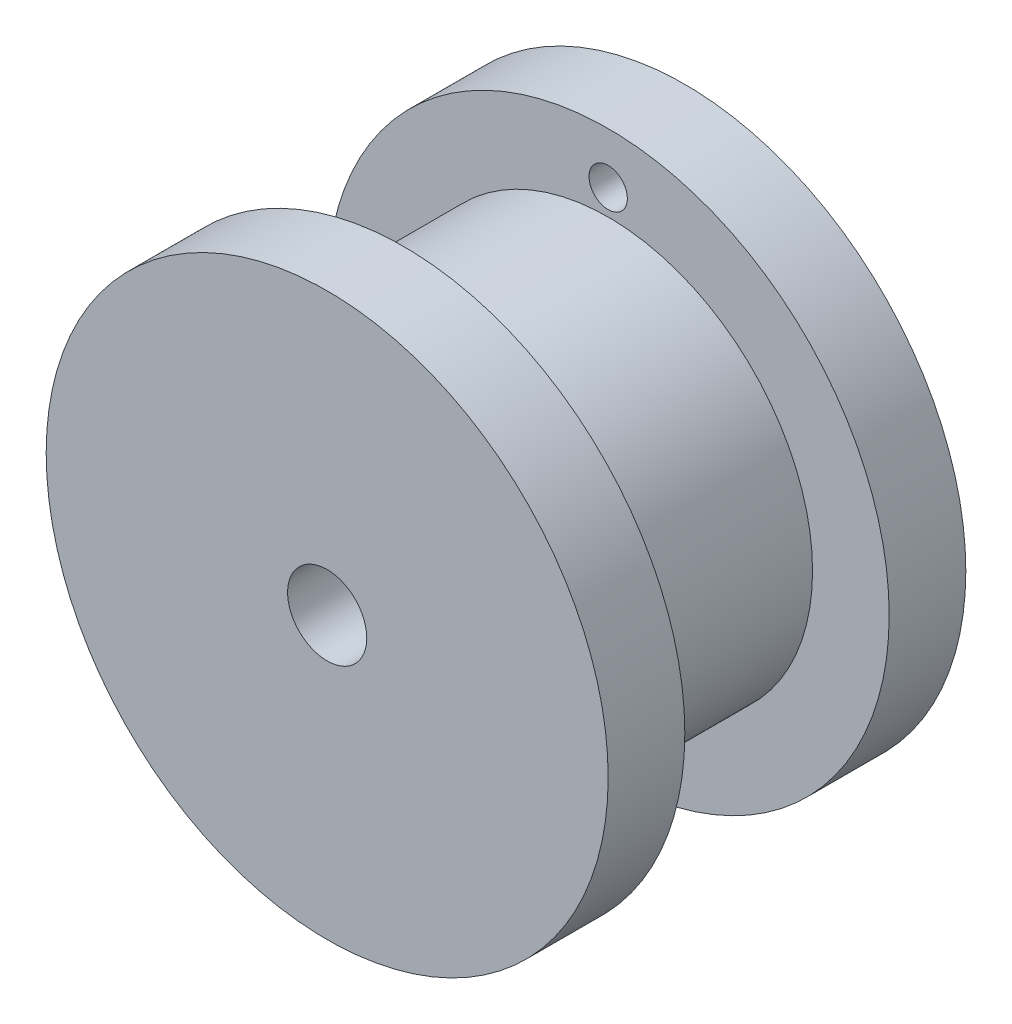
ISO-10303-21;
HEADER;
FILE_DESCRIPTION(('STEP AP214'),'2;1');
FILE_NAME('part.step','',(''),(''),'','','');
FILE_SCHEMA(('AUTOMOTIVE_DESIGN { 1 0 10303 214 1 1 1 1 }'));
ENDSEC;
DATA;
#1=APPLICATION_CONTEXT('core data for automotive mechanical design processes');
#2=APPLICATION_PROTOCOL_DEFINITION('international standard','automotive_design',2000,#1);
#3=PRODUCT_CONTEXT('',#1,'mechanical');
#4=PRODUCT('Part','Part','',(#3));
#5=PRODUCT_RELATED_PRODUCT_CATEGORY('part','',(#4));
#6=PRODUCT_DEFINITION_FORMATION('','',#4);
#7=PRODUCT_DEFINITION_CONTEXT('part definition',#1,'design');
#8=PRODUCT_DEFINITION('design','',#6,#7);
#9=PRODUCT_DEFINITION_SHAPE('','',#8);
#10=(LENGTH_UNIT() NAMED_UNIT(*) SI_UNIT(.MILLI.,.METRE.));
#11=(NAMED_UNIT(*) PLANE_ANGLE_UNIT() SI_UNIT($,.RADIAN.));
#12=(NAMED_UNIT(*) SI_UNIT($,.STERADIAN.) SOLID_ANGLE_UNIT());
#13=UNCERTAINTY_MEASURE_WITH_UNIT(LENGTH_MEASURE(1.E-05),#10,'distance_accuracy_value','');
#14=(GEOMETRIC_REPRESENTATION_CONTEXT(3) GLOBAL_UNCERTAINTY_ASSIGNED_CONTEXT((#13)) GLOBAL_UNIT_ASSIGNED_CONTEXT((#10,
#11,#12)) REPRESENTATION_CONTEXT('',''));
#15=CARTESIAN_POINT('',(0.,0.,0.));
#16=DIRECTION('',(0.,0.,1.));
#17=DIRECTION('',(1.,0.,0.));
#18=AXIS2_PLACEMENT_3D('',#15,#16,#17);
#19=CARTESIAN_POINT('',(0.,0.,3.));
#20=DIRECTION('',(0.,0.,-1.));
#21=DIRECTION('',(-1.,0.,0.));
#22=AXIS2_PLACEMENT_3D('',#19,#20,#21);
#23=CYLINDRICAL_SURFACE('',#22,11.);
#24=CARTESIAN_POINT('',(0.,0.,3.));
#25=DIRECTION('',(0.,0.,1.));
#26=DIRECTION('',(1.,0.,0.));
#27=AXIS2_PLACEMENT_3D('',#24,#25,#26);
#28=CIRCLE('',#27,11.);
#29=CARTESIAN_POINT('',(11.,0.,3.));
#30=VERTEX_POINT('',#29);
#31=EDGE_CURVE('E38',#30,#30,#28,.T.);
#32=ORIENTED_EDGE('',*,*,#31,.F.);
#33=EDGE_LOOP('',(#32));
#34=FACE_BOUND('',#33,.T.);
#35=CARTESIAN_POINT('',(0.,0.,0.));
#36=DIRECTION('',(0.,0.,1.));
#37=DIRECTION('',(1.,0.,0.));
#38=AXIS2_PLACEMENT_3D('',#35,#36,#37);
#39=CIRCLE('',#38,11.);
#40=CARTESIAN_POINT('',(11.,0.,0.));
#41=VERTEX_POINT('',#40);
#42=EDGE_CURVE('E34',#41,#41,#39,.T.);
#43=ORIENTED_EDGE('',*,*,#42,.T.);
#44=EDGE_LOOP('',(#43));
#45=FACE_BOUND('',#44,.T.);
#46=ADVANCED_FACE('F31',(#34,#45),#23,.T.);
#47=CARTESIAN_POINT('',(0.,0.,3.));
#48=DIRECTION('',(0.,0.,1.));
#49=DIRECTION('',(1.,0.,0.));
#50=AXIS2_PLACEMENT_3D('',#47,#48,#49);
#51=PLANE('',#50);
#52=CARTESIAN_POINT('',(0.,9.,3.));
#53=DIRECTION('',(0.,0.,1.));
#54=DIRECTION('',(1.,0.,0.));
#55=AXIS2_PLACEMENT_3D('',#52,#53,#54);
#56=CIRCLE('',#55,0.750000000000001);
#57=CARTESIAN_POINT('',(0.750000000000001,9.,3.));
#58=VERTEX_POINT('',#57);
#59=EDGE_CURVE('E60',#58,#58,#56,.T.);
#60=ORIENTED_EDGE('',*,*,#59,.F.);
#61=EDGE_LOOP('',(#60));
#62=FACE_BOUND('',#61,.T.);
#63=CARTESIAN_POINT('',(0.,0.,3.));
#64=DIRECTION('',(0.,0.,1.));
#65=DIRECTION('',(1.,0.,0.));
#66=AXIS2_PLACEMENT_3D('',#63,#64,#65);
#67=CIRCLE('',#66,8.);
#68=CARTESIAN_POINT('',(8.,0.,3.));
#69=VERTEX_POINT('',#68);
#70=EDGE_CURVE('E10',#69,#69,#67,.T.);
#71=ORIENTED_EDGE('',*,*,#70,.F.);
#72=EDGE_LOOP('',(#71));
#73=FACE_BOUND('',#72,.T.);
#74=ORIENTED_EDGE('',*,*,#31,.T.);
#75=EDGE_LOOP('',(#74));
#76=FACE_BOUND('',#75,.T.);
#77=ADVANCED_FACE('F76',(#62,#73,#76),#51,.T.);
#78=CARTESIAN_POINT('',(0.,0.,0.));
#79=DIRECTION('',(0.,0.,1.));
#80=DIRECTION('',(1.,0.,0.));
#81=AXIS2_PLACEMENT_3D('',#78,#79,#80);
#82=PLANE('',#81);
#83=CARTESIAN_POINT('',(0.,9.,0.));
#84=DIRECTION('',(0.,0.,1.));
#85=DIRECTION('',(1.,0.,0.));
#86=AXIS2_PLACEMENT_3D('',#83,#84,#85);
#87=CIRCLE('',#86,0.750000000000001);
#88=CARTESIAN_POINT('',(0.750000000000001,9.,0.));
#89=VERTEX_POINT('',#88);
#90=EDGE_CURVE('E57',#89,#89,#87,.T.);
#91=ORIENTED_EDGE('',*,*,#90,.T.);
#92=EDGE_LOOP('',(#91));
#93=FACE_BOUND('',#92,.T.);
#94=CARTESIAN_POINT('',(0.,0.,0.));
#95=DIRECTION('',(0.,0.,1.));
#96=DIRECTION('',(1.,0.,0.));
#97=AXIS2_PLACEMENT_3D('',#94,#95,#96);
#98=CIRCLE('',#97,1.55);
#99=CARTESIAN_POINT('',(1.55,0.,0.));
#100=VERTEX_POINT('',#99);
#101=EDGE_CURVE('E51',#100,#100,#98,.T.);
#102=ORIENTED_EDGE('',*,*,#101,.T.);
#103=EDGE_LOOP('',(#102));
#104=FACE_BOUND('',#103,.T.);
#105=ORIENTED_EDGE('',*,*,#42,.F.);
#106=EDGE_LOOP('',(#105));
#107=FACE_BOUND('',#106,.T.);
#108=ADVANCED_FACE('F66',(#93,#104,#107),#82,.F.);
#109=CARTESIAN_POINT('',(0.,0.,11.));
#110=DIRECTION('',(0.,0.,-1.));
#111=DIRECTION('',(-1.,0.,0.));
#112=AXIS2_PLACEMENT_3D('',#109,#110,#111);
#113=CYLINDRICAL_SURFACE('',#112,8.);
#114=CARTESIAN_POINT('',(0.,0.,11.));
#115=DIRECTION('',(0.,0.,1.));
#116=DIRECTION('',(1.,0.,0.));
#117=AXIS2_PLACEMENT_3D('',#114,#115,#116);
#118=CIRCLE('',#117,8.);
#119=CARTESIAN_POINT('',(8.,0.,11.));
#120=VERTEX_POINT('',#119);
#121=EDGE_CURVE('E44',#120,#120,#118,.T.);
#122=ORIENTED_EDGE('',*,*,#121,.F.);
#123=EDGE_LOOP('',(#122));
#124=FACE_BOUND('',#123,.T.);
#125=ORIENTED_EDGE('',*,*,#70,.T.);
#126=EDGE_LOOP('',(#125));
#127=FACE_BOUND('',#126,.T.);
#128=ADVANCED_FACE('F89',(#124,#127),#113,.T.);
#129=CARTESIAN_POINT('',(0.,0.,14.));
#130=DIRECTION('',(0.,0.,-1.));
#131=DIRECTION('',(-1.,0.,0.));
#132=AXIS2_PLACEMENT_3D('',#129,#130,#131);
#133=CYLINDRICAL_SURFACE('',#132,11.);
#134=CARTESIAN_POINT('',(0.,0.,14.));
#135=DIRECTION('',(0.,0.,1.));
#136=DIRECTION('',(1.,0.,0.));
#137=AXIS2_PLACEMENT_3D('',#134,#135,#136);
#138=CIRCLE('',#137,11.);
#139=CARTESIAN_POINT('',(11.,0.,14.));
#140=VERTEX_POINT('',#139);
#141=EDGE_CURVE('E47',#140,#140,#138,.T.);
#142=ORIENTED_EDGE('',*,*,#141,.F.);
#143=EDGE_LOOP('',(#142));
#144=FACE_BOUND('',#143,.T.);
#145=CARTESIAN_POINT('',(0.,0.,11.));
#146=DIRECTION('',(0.,0.,1.));
#147=DIRECTION('',(1.,0.,0.));
#148=AXIS2_PLACEMENT_3D('',#145,#146,#147);
#149=CIRCLE('',#148,11.);
#150=CARTESIAN_POINT('',(11.,0.,11.));
#151=VERTEX_POINT('',#150);
#152=EDGE_CURVE('E48',#151,#151,#149,.T.);
#153=ORIENTED_EDGE('',*,*,#152,.T.);
#154=EDGE_LOOP('',(#153));
#155=FACE_BOUND('',#154,.T.);
#156=ADVANCED_FACE('F93',(#144,#155),#133,.T.);
#157=CARTESIAN_POINT('',(0.,0.,14.));
#158=DIRECTION('',(0.,0.,1.));
#159=DIRECTION('',(1.,0.,0.));
#160=AXIS2_PLACEMENT_3D('',#157,#158,#159);
#161=PLANE('',#160);
#162=CARTESIAN_POINT('',(0.,0.,14.));
#163=DIRECTION('',(0.,0.,1.));
#164=DIRECTION('',(1.,0.,0.));
#165=AXIS2_PLACEMENT_3D('',#162,#163,#164);
#166=CIRCLE('',#165,1.55);
#167=CARTESIAN_POINT('',(1.55,0.,14.));
#168=VERTEX_POINT('',#167);
#169=EDGE_CURVE('E54',#168,#168,#166,.T.);
#170=ORIENTED_EDGE('',*,*,#169,.F.);
#171=EDGE_LOOP('',(#170));
#172=FACE_BOUND('',#171,.T.);
#173=ORIENTED_EDGE('',*,*,#141,.T.);
#174=EDGE_LOOP('',(#173));
#175=FACE_BOUND('',#174,.T.);
#176=ADVANCED_FACE('F99',(#172,#175),#161,.T.);
#177=CARTESIAN_POINT('',(0.,0.,11.));
#178=DIRECTION('',(0.,0.,1.));
#179=DIRECTION('',(1.,0.,0.));
#180=AXIS2_PLACEMENT_3D('',#177,#178,#179);
#181=PLANE('',#180);
#182=ORIENTED_EDGE('',*,*,#121,.T.);
#183=EDGE_LOOP('',(#182));
#184=FACE_BOUND('',#183,.T.);
#185=ORIENTED_EDGE('',*,*,#152,.F.);
#186=EDGE_LOOP('',(#185));
#187=FACE_BOUND('',#186,.T.);
#188=ADVANCED_FACE('F101',(#184,#187),#181,.F.);
#189=CARTESIAN_POINT('',(0.,0.,0.));
#190=DIRECTION('',(0.,0.,1.));
#191=DIRECTION('',(1.,0.,0.));
#192=AXIS2_PLACEMENT_3D('',#189,#190,#191);
#193=CYLINDRICAL_SURFACE('',#192,1.55);
#194=ORIENTED_EDGE('',*,*,#101,.F.);
#195=EDGE_LOOP('',(#194));
#196=FACE_BOUND('',#195,.T.);
#197=ORIENTED_EDGE('',*,*,#169,.T.);
#198=EDGE_LOOP('',(#197));
#199=FACE_BOUND('',#198,.T.);
#200=ADVANCED_FACE('F72',(#196,#199),#193,.F.);
#201=CARTESIAN_POINT('',(0.,9.,0.));
#202=DIRECTION('',(0.,0.,1.));
#203=DIRECTION('',(1.,0.,0.));
#204=AXIS2_PLACEMENT_3D('',#201,#202,#203);
#205=CYLINDRICAL_SURFACE('',#204,0.750000000000001);
#206=ORIENTED_EDGE('',*,*,#90,.F.);
#207=EDGE_LOOP('',(#206));
#208=FACE_BOUND('',#207,.T.);
#209=ORIENTED_EDGE('',*,*,#59,.T.);
#210=EDGE_LOOP('',(#209));
#211=FACE_BOUND('',#210,.T.);
#212=ADVANCED_FACE('F69',(#208,#211),#205,.F.);
#213=CLOSED_SHELL('',(#46,#77,#108,#128,#156,#176,#188,#200,#212));
#214=MANIFOLD_SOLID_BREP('B2',#213);
#215=ADVANCED_BREP_SHAPE_REPRESENTATION('',(#18,#214),#14);
#216=SHAPE_DEFINITION_REPRESENTATION(#9,#215);
ENDSEC;
END-ISO-10303-21;
